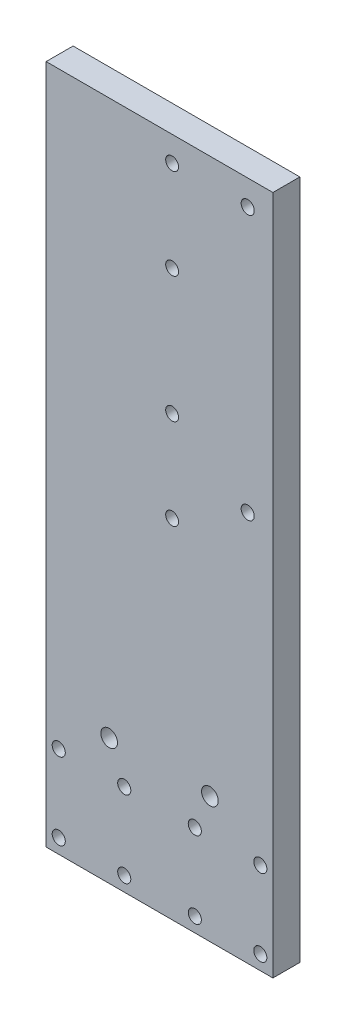
ISO-10303-21;
HEADER;
FILE_DESCRIPTION(('STEP AP214'),'2;1');
FILE_NAME('part.step','',(''),(''),'','','');
FILE_SCHEMA(('AUTOMOTIVE_DESIGN { 1 0 10303 214 1 1 1 1 }'));
ENDSEC;
DATA;
#1=APPLICATION_CONTEXT('core data for automotive mechanical design processes');
#2=APPLICATION_PROTOCOL_DEFINITION('international standard','automotive_design',2000,#1);
#3=PRODUCT_CONTEXT('',#1,'mechanical');
#4=PRODUCT('Part','Part','',(#3));
#5=PRODUCT_RELATED_PRODUCT_CATEGORY('part','',(#4));
#6=PRODUCT_DEFINITION_FORMATION('','',#4);
#7=PRODUCT_DEFINITION_CONTEXT('part definition',#1,'design');
#8=PRODUCT_DEFINITION('design','',#6,#7);
#9=PRODUCT_DEFINITION_SHAPE('','',#8);
#10=(LENGTH_UNIT() NAMED_UNIT(*) SI_UNIT(.MILLI.,.METRE.));
#11=(NAMED_UNIT(*) PLANE_ANGLE_UNIT() SI_UNIT($,.RADIAN.));
#12=(NAMED_UNIT(*) SI_UNIT($,.STERADIAN.) SOLID_ANGLE_UNIT());
#13=UNCERTAINTY_MEASURE_WITH_UNIT(LENGTH_MEASURE(1.E-05),#10,'distance_accuracy_value','');
#14=(GEOMETRIC_REPRESENTATION_CONTEXT(3) GLOBAL_UNCERTAINTY_ASSIGNED_CONTEXT((#13)) GLOBAL_UNIT_ASSIGNED_CONTEXT((#10,
#11,#12)) REPRESENTATION_CONTEXT('',''));
#15=CARTESIAN_POINT('',(0.,0.,0.));
#16=DIRECTION('',(0.,0.,1.));
#17=DIRECTION('',(1.,0.,0.));
#18=AXIS2_PLACEMENT_3D('',#15,#16,#17);
#19=CARTESIAN_POINT('',(0.,0.,10.7));
#20=DIRECTION('',(0.,0.,1.));
#21=DIRECTION('',(1.,0.,0.));
#22=AXIS2_PLACEMENT_3D('',#19,#20,#21);
#23=PLANE('',#22);
#24=CARTESIAN_POINT('',(5.,125.,10.7));
#25=DIRECTION('',(0.,0.,-1.));
#26=DIRECTION('',(-1.,0.,0.));
#27=AXIS2_PLACEMENT_3D('',#24,#25,#26);
#28=CIRCLE('',#27,2.5527);
#29=CARTESIAN_POINT('',(2.4473,125.,10.7));
#30=VERTEX_POINT('',#29);
#31=EDGE_CURVE('E204',#30,#30,#28,.T.);
#32=ORIENTED_EDGE('',*,*,#31,.T.);
#33=EDGE_LOOP('',(#32));
#34=FACE_BOUND('',#33,.T.);
#35=CARTESIAN_POINT('',(5.,89.,10.7));
#36=DIRECTION('',(0.,0.,-1.));
#37=DIRECTION('',(-1.,0.,0.));
#38=AXIS2_PLACEMENT_3D('',#35,#36,#37);
#39=CIRCLE('',#38,2.5527);
#40=CARTESIAN_POINT('',(2.4473,89.,10.7));
#41=VERTEX_POINT('',#40);
#42=EDGE_CURVE('E198',#41,#41,#39,.T.);
#43=ORIENTED_EDGE('',*,*,#42,.T.);
#44=EDGE_LOOP('',(#43));
#45=FACE_BOUND('',#44,.T.);
#46=CARTESIAN_POINT('',(5.,39.,10.7));
#47=DIRECTION('',(0.,0.,-1.));
#48=DIRECTION('',(-1.,0.,0.));
#49=AXIS2_PLACEMENT_3D('',#46,#47,#48);
#50=CIRCLE('',#49,2.5527);
#51=CARTESIAN_POINT('',(2.4473,39.,10.7));
#52=VERTEX_POINT('',#51);
#53=EDGE_CURVE('E192',#52,#52,#50,.T.);
#54=ORIENTED_EDGE('',*,*,#53,.T.);
#55=EDGE_LOOP('',(#54));
#56=FACE_BOUND('',#55,.T.);
#57=CARTESIAN_POINT('',(5.,3.00000000000002,10.7));
#58=DIRECTION('',(0.,0.,-1.));
#59=DIRECTION('',(-1.,0.,0.));
#60=AXIS2_PLACEMENT_3D('',#57,#58,#59);
#61=CIRCLE('',#60,2.5527);
#62=CARTESIAN_POINT('',(2.4473,3.00000000000002,10.7));
#63=VERTEX_POINT('',#62);
#64=EDGE_CURVE('E186',#63,#63,#61,.T.);
#65=ORIENTED_EDGE('',*,*,#64,.T.);
#66=EDGE_LOOP('',(#65));
#67=FACE_BOUND('',#66,.T.);
#68=CARTESIAN_POINT('',(35.,125.,10.7));
#69=DIRECTION('',(0.,0.,-1.));
#70=DIRECTION('',(-1.,0.,0.));
#71=AXIS2_PLACEMENT_3D('',#68,#69,#70);
#72=CIRCLE('',#71,2.6);
#73=CARTESIAN_POINT('',(32.4,125.,10.7));
#74=VERTEX_POINT('',#73);
#75=EDGE_CURVE('E180',#74,#74,#72,.T.);
#76=ORIENTED_EDGE('',*,*,#75,.T.);
#77=EDGE_LOOP('',(#76));
#78=FACE_BOUND('',#77,.T.);
#79=CARTESIAN_POINT('',(35.,20.,10.7));
#80=DIRECTION('',(0.,0.,-1.));
#81=DIRECTION('',(-1.,0.,0.));
#82=AXIS2_PLACEMENT_3D('',#79,#80,#81);
#83=CIRCLE('',#82,2.6);
#84=CARTESIAN_POINT('',(32.4,20.,10.7));
#85=VERTEX_POINT('',#84);
#86=EDGE_CURVE('E174',#85,#85,#83,.T.);
#87=ORIENTED_EDGE('',*,*,#86,.T.);
#88=EDGE_LOOP('',(#87));
#89=FACE_BOUND('',#88,.T.);
#90=DIRECTION('',(0.,-1.,0.));
#91=VECTOR('',#90,1.);
#92=CARTESIAN_POINT('',(-45.,-135.,10.7));
#93=LINE('',#92,#91);
#94=CARTESIAN_POINT('',(-45.,135.,10.7));
#95=VERTEX_POINT('',#94);
#96=CARTESIAN_POINT('',(-45.,-135.,10.7));
#97=VERTEX_POINT('',#96);
#98=EDGE_CURVE('E89',#95,#97,#93,.T.);
#99=ORIENTED_EDGE('',*,*,#98,.T.);
#100=DIRECTION('',(1.,0.,0.));
#101=VECTOR('',#100,1.);
#102=CARTESIAN_POINT('',(45.,-135.,10.7));
#103=LINE('',#102,#101);
#104=CARTESIAN_POINT('',(45.,-135.,10.7));
#105=VERTEX_POINT('',#104);
#106=EDGE_CURVE('E84',#97,#105,#103,.T.);
#107=ORIENTED_EDGE('',*,*,#106,.T.);
#108=DIRECTION('',(0.,1.,0.));
#109=VECTOR('',#108,1.);
#110=CARTESIAN_POINT('',(45.,-135.,10.7));
#111=LINE('',#110,#109);
#112=CARTESIAN_POINT('',(45.,135.,10.7));
#113=VERTEX_POINT('',#112);
#114=EDGE_CURVE('E87',#105,#113,#111,.T.);
#115=ORIENTED_EDGE('',*,*,#114,.T.);
#116=DIRECTION('',(-1.,0.,0.));
#117=VECTOR('',#116,1.);
#118=CARTESIAN_POINT('',(45.,135.,10.7));
#119=LINE('',#118,#117);
#120=EDGE_CURVE('E54',#113,#95,#119,.T.);
#121=ORIENTED_EDGE('',*,*,#120,.T.);
#122=EDGE_LOOP('',(#99,#107,#115,#121));
#123=FACE_BOUND('',#122,.T.);
#124=CARTESIAN_POINT('',(-40.,-98.75,10.7));
#125=DIRECTION('',(0.,0.,-1.));
#126=DIRECTION('',(-1.,0.,0.));
#127=AXIS2_PLACEMENT_3D('',#124,#125,#126);
#128=CIRCLE('',#127,2.6);
#129=CARTESIAN_POINT('',(-42.6,-98.75,10.7));
#130=VERTEX_POINT('',#129);
#131=EDGE_CURVE('E104',#130,#130,#128,.T.);
#132=ORIENTED_EDGE('',*,*,#131,.T.);
#133=EDGE_LOOP('',(#132));
#134=FACE_BOUND('',#133,.T.);
#135=CARTESIAN_POINT('',(-40.,-129.25,10.7));
#136=DIRECTION('',(0.,0.,-1.));
#137=DIRECTION('',(-1.,0.,0.));
#138=AXIS2_PLACEMENT_3D('',#135,#136,#137);
#139=CIRCLE('',#138,2.6);
#140=CARTESIAN_POINT('',(-42.6,-129.25,10.7));
#141=VERTEX_POINT('',#140);
#142=EDGE_CURVE('E120',#141,#141,#139,.T.);
#143=ORIENTED_EDGE('',*,*,#142,.T.);
#144=EDGE_LOOP('',(#143));
#145=FACE_BOUND('',#144,.T.);
#146=CARTESIAN_POINT('',(-14.,-129.25,10.7));
#147=DIRECTION('',(0.,0.,-1.));
#148=DIRECTION('',(-1.,0.,0.));
#149=AXIS2_PLACEMENT_3D('',#146,#147,#148);
#150=CIRCLE('',#149,2.6);
#151=CARTESIAN_POINT('',(-16.6,-129.25,10.7));
#152=VERTEX_POINT('',#151);
#153=EDGE_CURVE('E126',#152,#152,#150,.T.);
#154=ORIENTED_EDGE('',*,*,#153,.T.);
#155=EDGE_LOOP('',(#154));
#156=FACE_BOUND('',#155,.T.);
#157=CARTESIAN_POINT('',(-14.,-98.75,10.7));
#158=DIRECTION('',(0.,0.,-1.));
#159=DIRECTION('',(-1.,0.,0.));
#160=AXIS2_PLACEMENT_3D('',#157,#158,#159);
#161=CIRCLE('',#160,2.6);
#162=CARTESIAN_POINT('',(-16.6,-98.75,10.7));
#163=VERTEX_POINT('',#162);
#164=EDGE_CURVE('E132',#163,#163,#161,.T.);
#165=ORIENTED_EDGE('',*,*,#164,.T.);
#166=EDGE_LOOP('',(#165));
#167=FACE_BOUND('',#166,.T.);
#168=CARTESIAN_POINT('',(14.,-98.75,10.7));
#169=DIRECTION('',(0.,0.,-1.));
#170=DIRECTION('',(-1.,0.,0.));
#171=AXIS2_PLACEMENT_3D('',#168,#169,#170);
#172=CIRCLE('',#171,2.6);
#173=CARTESIAN_POINT('',(11.4,-98.75,10.7));
#174=VERTEX_POINT('',#173);
#175=EDGE_CURVE('E138',#174,#174,#172,.T.);
#176=ORIENTED_EDGE('',*,*,#175,.T.);
#177=EDGE_LOOP('',(#176));
#178=FACE_BOUND('',#177,.T.);
#179=CARTESIAN_POINT('',(14.,-129.25,10.7));
#180=DIRECTION('',(0.,0.,-1.));
#181=DIRECTION('',(-1.,0.,0.));
#182=AXIS2_PLACEMENT_3D('',#179,#180,#181);
#183=CIRCLE('',#182,2.6);
#184=CARTESIAN_POINT('',(11.4,-129.25,10.7));
#185=VERTEX_POINT('',#184);
#186=EDGE_CURVE('E144',#185,#185,#183,.T.);
#187=ORIENTED_EDGE('',*,*,#186,.T.);
#188=EDGE_LOOP('',(#187));
#189=FACE_BOUND('',#188,.T.);
#190=CARTESIAN_POINT('',(40.,-129.25,10.7));
#191=DIRECTION('',(0.,0.,-1.));
#192=DIRECTION('',(-1.,0.,0.));
#193=AXIS2_PLACEMENT_3D('',#190,#191,#192);
#194=CIRCLE('',#193,2.6);
#195=CARTESIAN_POINT('',(37.4,-129.25,10.7));
#196=VERTEX_POINT('',#195);
#197=EDGE_CURVE('E150',#196,#196,#194,.T.);
#198=ORIENTED_EDGE('',*,*,#197,.T.);
#199=EDGE_LOOP('',(#198));
#200=FACE_BOUND('',#199,.T.);
#201=CARTESIAN_POINT('',(40.,-98.75,10.7));
#202=DIRECTION('',(0.,0.,-1.));
#203=DIRECTION('',(-1.,0.,0.));
#204=AXIS2_PLACEMENT_3D('',#201,#202,#203);
#205=CIRCLE('',#204,2.6);
#206=CARTESIAN_POINT('',(37.4,-98.75,10.7));
#207=VERTEX_POINT('',#206);
#208=EDGE_CURVE('E156',#207,#207,#205,.T.);
#209=ORIENTED_EDGE('',*,*,#208,.T.);
#210=EDGE_LOOP('',(#209));
#211=FACE_BOUND('',#210,.T.);
#212=CARTESIAN_POINT('',(-20.,-85.,10.7));
#213=DIRECTION('',(0.,0.,-1.));
#214=DIRECTION('',(-1.,0.,0.));
#215=AXIS2_PLACEMENT_3D('',#212,#213,#214);
#216=CIRCLE('',#215,3.3147);
#217=CARTESIAN_POINT('',(-23.3147,-85.,10.7));
#218=VERTEX_POINT('',#217);
#219=EDGE_CURVE('E162',#218,#218,#216,.T.);
#220=ORIENTED_EDGE('',*,*,#219,.T.);
#221=EDGE_LOOP('',(#220));
#222=FACE_BOUND('',#221,.T.);
#223=CARTESIAN_POINT('',(20.,-85.,10.7));
#224=DIRECTION('',(0.,0.,-1.));
#225=DIRECTION('',(-1.,0.,0.));
#226=AXIS2_PLACEMENT_3D('',#223,#224,#225);
#227=CIRCLE('',#226,3.3147);
#228=CARTESIAN_POINT('',(16.6853,-85.,10.7));
#229=VERTEX_POINT('',#228);
#230=EDGE_CURVE('E168',#229,#229,#227,.T.);
#231=ORIENTED_EDGE('',*,*,#230,.T.);
#232=EDGE_LOOP('',(#231));
#233=FACE_BOUND('',#232,.T.);
#234=ADVANCED_FACE('F37',(#34,#45,#56,#67,#78,#89,#123,#134,#145,#156,#167,#178,#189,#200,#211,
#222,#233),#23,.T.);
#235=CARTESIAN_POINT('',(-45.,-135.,10.7));
#236=DIRECTION('',(1.,0.,0.));
#237=DIRECTION('',(0.,0.,-1.));
#238=AXIS2_PLACEMENT_3D('',#235,#236,#237);
#239=PLANE('',#238);
#240=DIRECTION('',(0.,-1.,0.));
#241=VECTOR('',#240,1.);
#242=CARTESIAN_POINT('',(-45.,-135.,0.));
#243=LINE('',#242,#241);
#244=CARTESIAN_POINT('',(-45.,135.,0.));
#245=VERTEX_POINT('',#244);
#246=CARTESIAN_POINT('',(-45.,-135.,0.));
#247=VERTEX_POINT('',#246);
#248=EDGE_CURVE('E101',#245,#247,#243,.T.);
#249=ORIENTED_EDGE('',*,*,#248,.T.);
#250=DIRECTION('',(0.,0.,-1.));
#251=VECTOR('',#250,1.);
#252=CARTESIAN_POINT('',(-45.,-135.,10.7));
#253=LINE('',#252,#251);
#254=EDGE_CURVE('E11',#97,#247,#253,.T.);
#255=ORIENTED_EDGE('',*,*,#254,.F.);
#256=ORIENTED_EDGE('',*,*,#98,.F.);
#257=DIRECTION('',(0.,0.,-1.));
#258=VECTOR('',#257,1.);
#259=CARTESIAN_POINT('',(-45.,135.,10.7));
#260=LINE('',#259,#258);
#261=EDGE_CURVE('E97',#95,#245,#260,.T.);
#262=ORIENTED_EDGE('',*,*,#261,.T.);
#263=EDGE_LOOP('',(#249,#255,#256,#262));
#264=FACE_BOUND('',#263,.T.);
#265=ADVANCED_FACE('F39',(#264),#239,.F.);
#266=CARTESIAN_POINT('',(45.,-135.,10.7));
#267=DIRECTION('',(0.,1.,0.));
#268=DIRECTION('',(0.,0.,1.));
#269=AXIS2_PLACEMENT_3D('',#266,#267,#268);
#270=PLANE('',#269);
#271=DIRECTION('',(1.,0.,0.));
#272=VECTOR('',#271,1.);
#273=CARTESIAN_POINT('',(45.,-135.,0.));
#274=LINE('',#273,#272);
#275=CARTESIAN_POINT('',(45.,-135.,0.));
#276=VERTEX_POINT('',#275);
#277=EDGE_CURVE('E93',#247,#276,#274,.T.);
#278=ORIENTED_EDGE('',*,*,#277,.T.);
#279=DIRECTION('',(0.,0.,-1.));
#280=VECTOR('',#279,1.);
#281=CARTESIAN_POINT('',(45.,-135.,10.7));
#282=LINE('',#281,#280);
#283=EDGE_CURVE('E46',#105,#276,#282,.T.);
#284=ORIENTED_EDGE('',*,*,#283,.F.);
#285=ORIENTED_EDGE('',*,*,#106,.F.);
#286=ORIENTED_EDGE('',*,*,#254,.T.);
#287=EDGE_LOOP('',(#278,#284,#285,#286));
#288=FACE_BOUND('',#287,.T.);
#289=ADVANCED_FACE('F92',(#288),#270,.F.);
#290=CARTESIAN_POINT('',(45.,-135.,10.7));
#291=DIRECTION('',(-1.,0.,0.));
#292=DIRECTION('',(0.,0.,1.));
#293=AXIS2_PLACEMENT_3D('',#290,#291,#292);
#294=PLANE('',#293);
#295=DIRECTION('',(0.,1.,0.));
#296=VECTOR('',#295,1.);
#297=CARTESIAN_POINT('',(45.,-135.,0.));
#298=LINE('',#297,#296);
#299=CARTESIAN_POINT('',(45.,135.,0.));
#300=VERTEX_POINT('',#299);
#301=EDGE_CURVE('E71',#276,#300,#298,.T.);
#302=ORIENTED_EDGE('',*,*,#301,.T.);
#303=DIRECTION('',(0.,0.,-1.));
#304=VECTOR('',#303,1.);
#305=CARTESIAN_POINT('',(45.,135.,10.7));
#306=LINE('',#305,#304);
#307=EDGE_CURVE('E94',#113,#300,#306,.T.);
#308=ORIENTED_EDGE('',*,*,#307,.F.);
#309=ORIENTED_EDGE('',*,*,#114,.F.);
#310=ORIENTED_EDGE('',*,*,#283,.T.);
#311=EDGE_LOOP('',(#302,#308,#309,#310));
#312=FACE_BOUND('',#311,.T.);
#313=ADVANCED_FACE('F95',(#312),#294,.F.);
#314=CARTESIAN_POINT('',(45.,135.,10.7));
#315=DIRECTION('',(0.,-1.,0.));
#316=DIRECTION('',(0.,0.,-1.));
#317=AXIS2_PLACEMENT_3D('',#314,#315,#316);
#318=PLANE('',#317);
#319=DIRECTION('',(-1.,0.,0.));
#320=VECTOR('',#319,1.);
#321=CARTESIAN_POINT('',(45.,135.,0.));
#322=LINE('',#321,#320);
#323=EDGE_CURVE('E77',#300,#245,#322,.T.);
#324=ORIENTED_EDGE('',*,*,#323,.T.);
#325=ORIENTED_EDGE('',*,*,#261,.F.);
#326=ORIENTED_EDGE('',*,*,#120,.F.);
#327=ORIENTED_EDGE('',*,*,#307,.T.);
#328=EDGE_LOOP('',(#324,#325,#326,#327));
#329=FACE_BOUND('',#328,.T.);
#330=ADVANCED_FACE('F109',(#329),#318,.F.);
#331=CARTESIAN_POINT('',(0.,0.,0.));
#332=DIRECTION('',(0.,0.,1.));
#333=DIRECTION('',(1.,0.,0.));
#334=AXIS2_PLACEMENT_3D('',#331,#332,#333);
#335=PLANE('',#334);
#336=CARTESIAN_POINT('',(4.,64.,0.));
#337=DIRECTION('',(0.,0.,-1.));
#338=DIRECTION('',(-1.,0.,0.));
#339=AXIS2_PLACEMENT_3D('',#336,#337,#338);
#340=CIRCLE('',#339,11.);
#341=CARTESIAN_POINT('',(-7.,64.,0.));
#342=VERTEX_POINT('',#341);
#343=EDGE_CURVE('E211',#342,#342,#340,.T.);
#344=ORIENTED_EDGE('',*,*,#343,.F.);
#345=EDGE_LOOP('',(#344));
#346=FACE_BOUND('',#345,.T.);
#347=CARTESIAN_POINT('',(5.,125.,0.));
#348=DIRECTION('',(0.,0.,-1.));
#349=DIRECTION('',(-1.,0.,0.));
#350=AXIS2_PLACEMENT_3D('',#347,#348,#349);
#351=CIRCLE('',#350,2.5527);
#352=CARTESIAN_POINT('',(2.4473,125.,0.));
#353=VERTEX_POINT('',#352);
#354=EDGE_CURVE('E207',#353,#353,#351,.T.);
#355=ORIENTED_EDGE('',*,*,#354,.F.);
#356=EDGE_LOOP('',(#355));
#357=FACE_BOUND('',#356,.T.);
#358=CARTESIAN_POINT('',(5.,89.,0.));
#359=DIRECTION('',(0.,0.,-1.));
#360=DIRECTION('',(-1.,0.,0.));
#361=AXIS2_PLACEMENT_3D('',#358,#359,#360);
#362=CIRCLE('',#361,2.5527);
#363=CARTESIAN_POINT('',(2.4473,89.,0.));
#364=VERTEX_POINT('',#363);
#365=EDGE_CURVE('E201',#364,#364,#362,.T.);
#366=ORIENTED_EDGE('',*,*,#365,.F.);
#367=EDGE_LOOP('',(#366));
#368=FACE_BOUND('',#367,.T.);
#369=CARTESIAN_POINT('',(5.,39.,0.));
#370=DIRECTION('',(0.,0.,-1.));
#371=DIRECTION('',(-1.,0.,0.));
#372=AXIS2_PLACEMENT_3D('',#369,#370,#371);
#373=CIRCLE('',#372,2.5527);
#374=CARTESIAN_POINT('',(2.4473,39.,0.));
#375=VERTEX_POINT('',#374);
#376=EDGE_CURVE('E195',#375,#375,#373,.T.);
#377=ORIENTED_EDGE('',*,*,#376,.F.);
#378=EDGE_LOOP('',(#377));
#379=FACE_BOUND('',#378,.T.);
#380=CARTESIAN_POINT('',(5.,3.00000000000002,0.));
#381=DIRECTION('',(0.,0.,-1.));
#382=DIRECTION('',(-1.,0.,0.));
#383=AXIS2_PLACEMENT_3D('',#380,#381,#382);
#384=CIRCLE('',#383,2.5527);
#385=CARTESIAN_POINT('',(2.4473,3.00000000000002,0.));
#386=VERTEX_POINT('',#385);
#387=EDGE_CURVE('E189',#386,#386,#384,.T.);
#388=ORIENTED_EDGE('',*,*,#387,.F.);
#389=EDGE_LOOP('',(#388));
#390=FACE_BOUND('',#389,.T.);
#391=CARTESIAN_POINT('',(35.,125.,0.));
#392=DIRECTION('',(0.,0.,-1.));
#393=DIRECTION('',(-1.,0.,0.));
#394=AXIS2_PLACEMENT_3D('',#391,#392,#393);
#395=CIRCLE('',#394,2.6);
#396=CARTESIAN_POINT('',(32.4,125.,0.));
#397=VERTEX_POINT('',#396);
#398=EDGE_CURVE('E183',#397,#397,#395,.T.);
#399=ORIENTED_EDGE('',*,*,#398,.F.);
#400=EDGE_LOOP('',(#399));
#401=FACE_BOUND('',#400,.T.);
#402=CARTESIAN_POINT('',(35.,20.,0.));
#403=DIRECTION('',(0.,0.,-1.));
#404=DIRECTION('',(-1.,0.,0.));
#405=AXIS2_PLACEMENT_3D('',#402,#403,#404);
#406=CIRCLE('',#405,2.6);
#407=CARTESIAN_POINT('',(32.4,20.,0.));
#408=VERTEX_POINT('',#407);
#409=EDGE_CURVE('E177',#408,#408,#406,.T.);
#410=ORIENTED_EDGE('',*,*,#409,.F.);
#411=EDGE_LOOP('',(#410));
#412=FACE_BOUND('',#411,.T.);
#413=CARTESIAN_POINT('',(20.,-85.,0.));
#414=DIRECTION('',(0.,0.,-1.));
#415=DIRECTION('',(-1.,0.,0.));
#416=AXIS2_PLACEMENT_3D('',#413,#414,#415);
#417=CIRCLE('',#416,3.3147);
#418=CARTESIAN_POINT('',(16.6853,-85.,0.));
#419=VERTEX_POINT('',#418);
#420=EDGE_CURVE('E171',#419,#419,#417,.T.);
#421=ORIENTED_EDGE('',*,*,#420,.F.);
#422=EDGE_LOOP('',(#421));
#423=FACE_BOUND('',#422,.T.);
#424=CARTESIAN_POINT('',(-20.,-85.,0.));
#425=DIRECTION('',(0.,0.,-1.));
#426=DIRECTION('',(-1.,0.,0.));
#427=AXIS2_PLACEMENT_3D('',#424,#425,#426);
#428=CIRCLE('',#427,3.3147);
#429=CARTESIAN_POINT('',(-23.3147,-85.,0.));
#430=VERTEX_POINT('',#429);
#431=EDGE_CURVE('E165',#430,#430,#428,.T.);
#432=ORIENTED_EDGE('',*,*,#431,.F.);
#433=EDGE_LOOP('',(#432));
#434=FACE_BOUND('',#433,.T.);
#435=CARTESIAN_POINT('',(40.,-98.75,0.));
#436=DIRECTION('',(0.,0.,-1.));
#437=DIRECTION('',(-1.,0.,0.));
#438=AXIS2_PLACEMENT_3D('',#435,#436,#437);
#439=CIRCLE('',#438,2.59999999999998);
#440=CARTESIAN_POINT('',(37.4,-98.75,0.));
#441=VERTEX_POINT('',#440);
#442=EDGE_CURVE('E159',#441,#441,#439,.T.);
#443=ORIENTED_EDGE('',*,*,#442,.F.);
#444=EDGE_LOOP('',(#443));
#445=FACE_BOUND('',#444,.T.);
#446=CARTESIAN_POINT('',(40.,-129.25,0.));
#447=DIRECTION('',(0.,0.,-1.));
#448=DIRECTION('',(-1.,0.,0.));
#449=AXIS2_PLACEMENT_3D('',#446,#447,#448);
#450=CIRCLE('',#449,2.59999999999999);
#451=CARTESIAN_POINT('',(37.4,-129.25,0.));
#452=VERTEX_POINT('',#451);
#453=EDGE_CURVE('E153',#452,#452,#450,.T.);
#454=ORIENTED_EDGE('',*,*,#453,.F.);
#455=EDGE_LOOP('',(#454));
#456=FACE_BOUND('',#455,.T.);
#457=CARTESIAN_POINT('',(14.,-129.25,0.));
#458=DIRECTION('',(0.,0.,-1.));
#459=DIRECTION('',(-1.,0.,0.));
#460=AXIS2_PLACEMENT_3D('',#457,#458,#459);
#461=CIRCLE('',#460,2.59999999999999);
#462=CARTESIAN_POINT('',(11.4,-129.25,0.));
#463=VERTEX_POINT('',#462);
#464=EDGE_CURVE('E147',#463,#463,#461,.T.);
#465=ORIENTED_EDGE('',*,*,#464,.F.);
#466=EDGE_LOOP('',(#465));
#467=FACE_BOUND('',#466,.T.);
#468=CARTESIAN_POINT('',(14.,-98.75,0.));
#469=DIRECTION('',(0.,0.,-1.));
#470=DIRECTION('',(-1.,0.,0.));
#471=AXIS2_PLACEMENT_3D('',#468,#469,#470);
#472=CIRCLE('',#471,2.59999999999999);
#473=CARTESIAN_POINT('',(11.4,-98.75,0.));
#474=VERTEX_POINT('',#473);
#475=EDGE_CURVE('E141',#474,#474,#472,.T.);
#476=ORIENTED_EDGE('',*,*,#475,.F.);
#477=EDGE_LOOP('',(#476));
#478=FACE_BOUND('',#477,.T.);
#479=CARTESIAN_POINT('',(-14.,-98.75,0.));
#480=DIRECTION('',(0.,0.,-1.));
#481=DIRECTION('',(-1.,0.,0.));
#482=AXIS2_PLACEMENT_3D('',#479,#480,#481);
#483=CIRCLE('',#482,2.59999999999999);
#484=CARTESIAN_POINT('',(-16.6,-98.75,0.));
#485=VERTEX_POINT('',#484);
#486=EDGE_CURVE('E135',#485,#485,#483,.T.);
#487=ORIENTED_EDGE('',*,*,#486,.F.);
#488=EDGE_LOOP('',(#487));
#489=FACE_BOUND('',#488,.T.);
#490=CARTESIAN_POINT('',(-14.,-129.25,0.));
#491=DIRECTION('',(0.,0.,-1.));
#492=DIRECTION('',(-1.,0.,0.));
#493=AXIS2_PLACEMENT_3D('',#490,#491,#492);
#494=CIRCLE('',#493,2.59999999999999);
#495=CARTESIAN_POINT('',(-16.6,-129.25,0.));
#496=VERTEX_POINT('',#495);
#497=EDGE_CURVE('E129',#496,#496,#494,.T.);
#498=ORIENTED_EDGE('',*,*,#497,.F.);
#499=EDGE_LOOP('',(#498));
#500=FACE_BOUND('',#499,.T.);
#501=CARTESIAN_POINT('',(-40.,-129.25,0.));
#502=DIRECTION('',(0.,0.,-1.));
#503=DIRECTION('',(-1.,0.,0.));
#504=AXIS2_PLACEMENT_3D('',#501,#502,#503);
#505=CIRCLE('',#504,2.59999999999999);
#506=CARTESIAN_POINT('',(-42.6,-129.25,0.));
#507=VERTEX_POINT('',#506);
#508=EDGE_CURVE('E123',#507,#507,#505,.T.);
#509=ORIENTED_EDGE('',*,*,#508,.F.);
#510=EDGE_LOOP('',(#509));
#511=FACE_BOUND('',#510,.T.);
#512=CARTESIAN_POINT('',(-40.,-98.75,0.));
#513=DIRECTION('',(0.,0.,-1.));
#514=DIRECTION('',(-1.,0.,0.));
#515=AXIS2_PLACEMENT_3D('',#512,#513,#514);
#516=CIRCLE('',#515,2.59999999999998);
#517=CARTESIAN_POINT('',(-42.6,-98.75,0.));
#518=VERTEX_POINT('',#517);
#519=EDGE_CURVE('E117',#518,#518,#516,.T.);
#520=ORIENTED_EDGE('',*,*,#519,.F.);
#521=EDGE_LOOP('',(#520));
#522=FACE_BOUND('',#521,.T.);
#523=ORIENTED_EDGE('',*,*,#248,.F.);
#524=ORIENTED_EDGE('',*,*,#323,.F.);
#525=ORIENTED_EDGE('',*,*,#301,.F.);
#526=ORIENTED_EDGE('',*,*,#277,.F.);
#527=EDGE_LOOP('',(#523,#524,#525,#526));
#528=FACE_BOUND('',#527,.T.);
#529=ADVANCED_FACE('F112',(#346,#357,#368,#379,#390,#401,#412,#423,#434,#445,#456,#467,#478,
#489,#500,#511,#522,#528),#335,.F.);
#530=CARTESIAN_POINT('',(-40.,-98.75,0.));
#531=DIRECTION('',(0.,0.,-1.));
#532=DIRECTION('',(-1.,0.,0.));
#533=AXIS2_PLACEMENT_3D('',#530,#531,#532);
#534=CYLINDRICAL_SURFACE('',#533,2.59999999999999);
#535=ORIENTED_EDGE('',*,*,#131,.F.);
#536=EDGE_LOOP('',(#535));
#537=FACE_BOUND('',#536,.T.);
#538=ORIENTED_EDGE('',*,*,#519,.T.);
#539=EDGE_LOOP('',(#538));
#540=FACE_BOUND('',#539,.T.);
#541=ADVANCED_FACE('F228',(#537,#540),#534,.F.);
#542=CARTESIAN_POINT('',(-40.,-129.25,0.));
#543=DIRECTION('',(0.,0.,-1.));
#544=DIRECTION('',(-1.,0.,0.));
#545=AXIS2_PLACEMENT_3D('',#542,#543,#544);
#546=CYLINDRICAL_SURFACE('',#545,2.59999999999999);
#547=ORIENTED_EDGE('',*,*,#142,.F.);
#548=EDGE_LOOP('',(#547));
#549=FACE_BOUND('',#548,.T.);
#550=ORIENTED_EDGE('',*,*,#508,.T.);
#551=EDGE_LOOP('',(#550));
#552=FACE_BOUND('',#551,.T.);
#553=ADVANCED_FACE('F263',(#549,#552),#546,.F.);
#554=CARTESIAN_POINT('',(-14.,-129.25,0.));
#555=DIRECTION('',(0.,0.,-1.));
#556=DIRECTION('',(-1.,0.,0.));
#557=AXIS2_PLACEMENT_3D('',#554,#555,#556);
#558=CYLINDRICAL_SURFACE('',#557,2.59999999999999);
#559=ORIENTED_EDGE('',*,*,#153,.F.);
#560=EDGE_LOOP('',(#559));
#561=FACE_BOUND('',#560,.T.);
#562=ORIENTED_EDGE('',*,*,#497,.T.);
#563=EDGE_LOOP('',(#562));
#564=FACE_BOUND('',#563,.T.);
#565=ADVANCED_FACE('F269',(#561,#564),#558,.F.);
#566=CARTESIAN_POINT('',(-14.,-98.75,0.));
#567=DIRECTION('',(0.,0.,-1.));
#568=DIRECTION('',(-1.,0.,0.));
#569=AXIS2_PLACEMENT_3D('',#566,#567,#568);
#570=CYLINDRICAL_SURFACE('',#569,2.59999999999999);
#571=ORIENTED_EDGE('',*,*,#164,.F.);
#572=EDGE_LOOP('',(#571));
#573=FACE_BOUND('',#572,.T.);
#574=ORIENTED_EDGE('',*,*,#486,.T.);
#575=EDGE_LOOP('',(#574));
#576=FACE_BOUND('',#575,.T.);
#577=ADVANCED_FACE('F373',(#573,#576),#570,.F.);
#578=CARTESIAN_POINT('',(14.,-98.75,0.));
#579=DIRECTION('',(0.,0.,-1.));
#580=DIRECTION('',(-1.,0.,0.));
#581=AXIS2_PLACEMENT_3D('',#578,#579,#580);
#582=CYLINDRICAL_SURFACE('',#581,2.59999999999999);
#583=ORIENTED_EDGE('',*,*,#175,.F.);
#584=EDGE_LOOP('',(#583));
#585=FACE_BOUND('',#584,.T.);
#586=ORIENTED_EDGE('',*,*,#475,.T.);
#587=EDGE_LOOP('',(#586));
#588=FACE_BOUND('',#587,.T.);
#589=ADVANCED_FACE('F369',(#585,#588),#582,.F.);
#590=CARTESIAN_POINT('',(14.,-129.25,0.));
#591=DIRECTION('',(0.,0.,-1.));
#592=DIRECTION('',(-1.,0.,0.));
#593=AXIS2_PLACEMENT_3D('',#590,#591,#592);
#594=CYLINDRICAL_SURFACE('',#593,2.59999999999999);
#595=ORIENTED_EDGE('',*,*,#186,.F.);
#596=EDGE_LOOP('',(#595));
#597=FACE_BOUND('',#596,.T.);
#598=ORIENTED_EDGE('',*,*,#464,.T.);
#599=EDGE_LOOP('',(#598));
#600=FACE_BOUND('',#599,.T.);
#601=ADVANCED_FACE('F365',(#597,#600),#594,.F.);
#602=CARTESIAN_POINT('',(40.,-129.25,0.));
#603=DIRECTION('',(0.,0.,-1.));
#604=DIRECTION('',(-1.,0.,0.));
#605=AXIS2_PLACEMENT_3D('',#602,#603,#604);
#606=CYLINDRICAL_SURFACE('',#605,2.59999999999999);
#607=ORIENTED_EDGE('',*,*,#197,.F.);
#608=EDGE_LOOP('',(#607));
#609=FACE_BOUND('',#608,.T.);
#610=ORIENTED_EDGE('',*,*,#453,.T.);
#611=EDGE_LOOP('',(#610));
#612=FACE_BOUND('',#611,.T.);
#613=ADVANCED_FACE('F361',(#609,#612),#606,.F.);
#614=CARTESIAN_POINT('',(40.,-98.75,0.));
#615=DIRECTION('',(0.,0.,-1.));
#616=DIRECTION('',(-1.,0.,0.));
#617=AXIS2_PLACEMENT_3D('',#614,#615,#616);
#618=CYLINDRICAL_SURFACE('',#617,2.59999999999999);
#619=ORIENTED_EDGE('',*,*,#208,.F.);
#620=EDGE_LOOP('',(#619));
#621=FACE_BOUND('',#620,.T.);
#622=ORIENTED_EDGE('',*,*,#442,.T.);
#623=EDGE_LOOP('',(#622));
#624=FACE_BOUND('',#623,.T.);
#625=ADVANCED_FACE('F357',(#621,#624),#618,.F.);
#626=CARTESIAN_POINT('',(-20.,-85.,0.));
#627=DIRECTION('',(0.,0.,-1.));
#628=DIRECTION('',(-1.,0.,0.));
#629=AXIS2_PLACEMENT_3D('',#626,#627,#628);
#630=CYLINDRICAL_SURFACE('',#629,3.3147);
#631=ORIENTED_EDGE('',*,*,#219,.F.);
#632=EDGE_LOOP('',(#631));
#633=FACE_BOUND('',#632,.T.);
#634=ORIENTED_EDGE('',*,*,#431,.T.);
#635=EDGE_LOOP('',(#634));
#636=FACE_BOUND('',#635,.T.);
#637=ADVANCED_FACE('F353',(#633,#636),#630,.F.);
#638=CARTESIAN_POINT('',(20.,-85.,0.));
#639=DIRECTION('',(0.,0.,-1.));
#640=DIRECTION('',(-1.,0.,0.));
#641=AXIS2_PLACEMENT_3D('',#638,#639,#640);
#642=CYLINDRICAL_SURFACE('',#641,3.3147);
#643=ORIENTED_EDGE('',*,*,#230,.F.);
#644=EDGE_LOOP('',(#643));
#645=FACE_BOUND('',#644,.T.);
#646=ORIENTED_EDGE('',*,*,#420,.T.);
#647=EDGE_LOOP('',(#646));
#648=FACE_BOUND('',#647,.T.);
#649=ADVANCED_FACE('F349',(#645,#648),#642,.F.);
#650=CARTESIAN_POINT('',(35.,20.,0.));
#651=DIRECTION('',(0.,0.,-1.));
#652=DIRECTION('',(-1.,0.,0.));
#653=AXIS2_PLACEMENT_3D('',#650,#651,#652);
#654=CYLINDRICAL_SURFACE('',#653,2.6);
#655=ORIENTED_EDGE('',*,*,#86,.F.);
#656=EDGE_LOOP('',(#655));
#657=FACE_BOUND('',#656,.T.);
#658=ORIENTED_EDGE('',*,*,#409,.T.);
#659=EDGE_LOOP('',(#658));
#660=FACE_BOUND('',#659,.T.);
#661=ADVANCED_FACE('F345',(#657,#660),#654,.F.);
#662=CARTESIAN_POINT('',(35.,125.,0.));
#663=DIRECTION('',(0.,0.,-1.));
#664=DIRECTION('',(-1.,0.,0.));
#665=AXIS2_PLACEMENT_3D('',#662,#663,#664);
#666=CYLINDRICAL_SURFACE('',#665,2.6);
#667=ORIENTED_EDGE('',*,*,#75,.F.);
#668=EDGE_LOOP('',(#667));
#669=FACE_BOUND('',#668,.T.);
#670=ORIENTED_EDGE('',*,*,#398,.T.);
#671=EDGE_LOOP('',(#670));
#672=FACE_BOUND('',#671,.T.);
#673=ADVANCED_FACE('F341',(#669,#672),#666,.F.);
#674=CARTESIAN_POINT('',(5.,3.00000000000002,0.));
#675=DIRECTION('',(0.,0.,-1.));
#676=DIRECTION('',(-1.,0.,0.));
#677=AXIS2_PLACEMENT_3D('',#674,#675,#676);
#678=CYLINDRICAL_SURFACE('',#677,2.5527);
#679=ORIENTED_EDGE('',*,*,#64,.F.);
#680=EDGE_LOOP('',(#679));
#681=FACE_BOUND('',#680,.T.);
#682=ORIENTED_EDGE('',*,*,#387,.T.);
#683=EDGE_LOOP('',(#682));
#684=FACE_BOUND('',#683,.T.);
#685=ADVANCED_FACE('F337',(#681,#684),#678,.F.);
#686=CARTESIAN_POINT('',(5.,39.,0.));
#687=DIRECTION('',(0.,0.,-1.));
#688=DIRECTION('',(-1.,0.,0.));
#689=AXIS2_PLACEMENT_3D('',#686,#687,#688);
#690=CYLINDRICAL_SURFACE('',#689,2.5527);
#691=ORIENTED_EDGE('',*,*,#53,.F.);
#692=EDGE_LOOP('',(#691));
#693=FACE_BOUND('',#692,.T.);
#694=ORIENTED_EDGE('',*,*,#376,.T.);
#695=EDGE_LOOP('',(#694));
#696=FACE_BOUND('',#695,.T.);
#697=ADVANCED_FACE('F333',(#693,#696),#690,.F.);
#698=CARTESIAN_POINT('',(5.,89.,0.));
#699=DIRECTION('',(0.,0.,-1.));
#700=DIRECTION('',(-1.,0.,0.));
#701=AXIS2_PLACEMENT_3D('',#698,#699,#700);
#702=CYLINDRICAL_SURFACE('',#701,2.5527);
#703=ORIENTED_EDGE('',*,*,#42,.F.);
#704=EDGE_LOOP('',(#703));
#705=FACE_BOUND('',#704,.T.);
#706=ORIENTED_EDGE('',*,*,#365,.T.);
#707=EDGE_LOOP('',(#706));
#708=FACE_BOUND('',#707,.T.);
#709=ADVANCED_FACE('F329',(#705,#708),#702,.F.);
#710=CARTESIAN_POINT('',(5.,125.,0.));
#711=DIRECTION('',(0.,0.,-1.));
#712=DIRECTION('',(-1.,0.,0.));
#713=AXIS2_PLACEMENT_3D('',#710,#711,#712);
#714=CYLINDRICAL_SURFACE('',#713,2.5527);
#715=ORIENTED_EDGE('',*,*,#31,.F.);
#716=EDGE_LOOP('',(#715));
#717=FACE_BOUND('',#716,.T.);
#718=ORIENTED_EDGE('',*,*,#354,.T.);
#719=EDGE_LOOP('',(#718));
#720=FACE_BOUND('',#719,.T.);
#721=ADVANCED_FACE('F222',(#717,#720),#714,.F.);
#722=CARTESIAN_POINT('',(4.,64.,7.));
#723=DIRECTION('',(0.,0.,-1.));
#724=DIRECTION('',(-1.,0.,0.));
#725=AXIS2_PLACEMENT_3D('',#722,#723,#724);
#726=CYLINDRICAL_SURFACE('',#725,11.);
#727=CARTESIAN_POINT('',(4.,64.,7.));
#728=DIRECTION('',(0.,0.,-1.));
#729=DIRECTION('',(-1.,0.,0.));
#730=AXIS2_PLACEMENT_3D('',#727,#728,#729);
#731=CIRCLE('',#730,11.);
#732=CARTESIAN_POINT('',(-7.,64.,7.));
#733=VERTEX_POINT('',#732);
#734=EDGE_CURVE('E210',#733,#733,#731,.T.);
#735=ORIENTED_EDGE('',*,*,#734,.F.);
#736=EDGE_LOOP('',(#735));
#737=FACE_BOUND('',#736,.T.);
#738=ORIENTED_EDGE('',*,*,#343,.T.);
#739=EDGE_LOOP('',(#738));
#740=FACE_BOUND('',#739,.T.);
#741=ADVANCED_FACE('F219',(#737,#740),#726,.F.);
#742=CARTESIAN_POINT('',(4.,64.,7.));
#743=DIRECTION('',(0.,0.,-1.));
#744=DIRECTION('',(-1.,0.,0.));
#745=AXIS2_PLACEMENT_3D('',#742,#743,#744);
#746=PLANE('',#745);
#747=ORIENTED_EDGE('',*,*,#734,.T.);
#748=EDGE_LOOP('',(#747));
#749=FACE_BOUND('',#748,.T.);
#750=ADVANCED_FACE('F217',(#749),#746,.T.);
#751=CLOSED_SHELL('',(#234,#265,#289,#313,#330,#529,#541,#553,#565,#577,#589,#601,#613,#625,
#637,#649,#661,#673,#685,#697,#709,#721,#741,#750));
#752=MANIFOLD_SOLID_BREP('B2',#751);
#753=ADVANCED_BREP_SHAPE_REPRESENTATION('',(#18,#752),#14);
#754=SHAPE_DEFINITION_REPRESENTATION(#9,#753);
ENDSEC;
END-ISO-10303-21;
